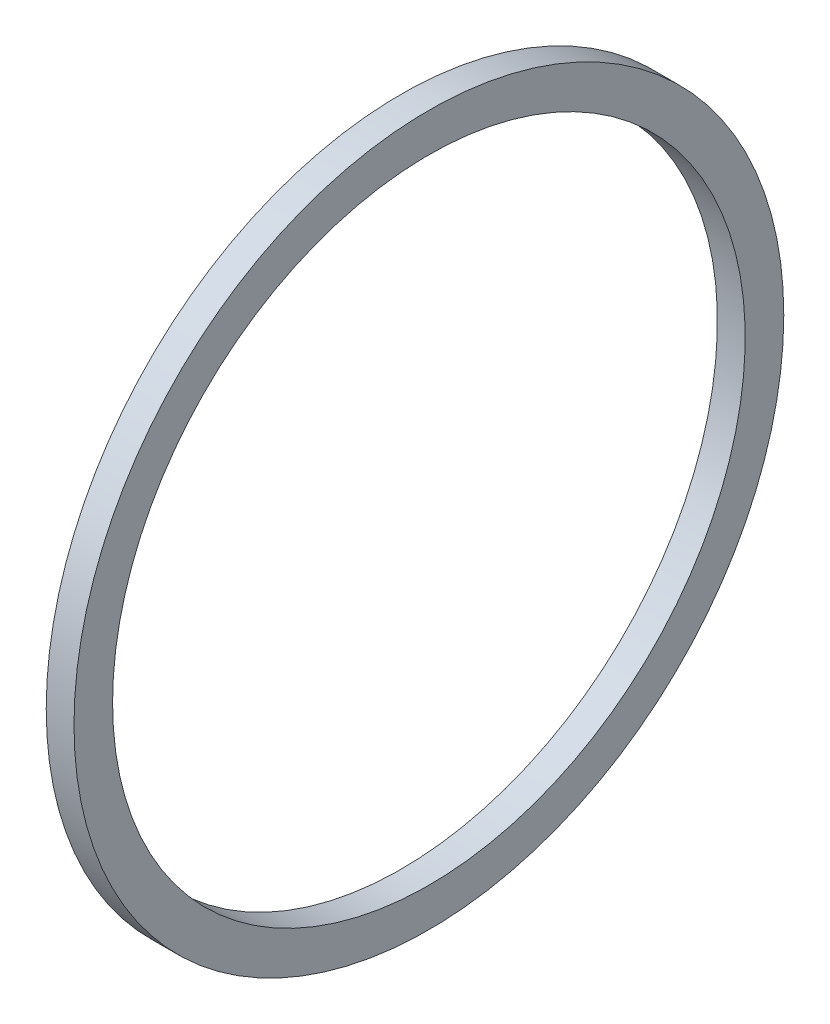
ISO-10303-21;
HEADER;
FILE_DESCRIPTION(('STEP AP214'),'2;1');
FILE_NAME('part.step','',(''),(''),'','','');
FILE_SCHEMA(('AUTOMOTIVE_DESIGN { 1 0 10303 214 1 1 1 1 }'));
ENDSEC;
DATA;
#1=APPLICATION_CONTEXT('core data for automotive mechanical design processes');
#2=APPLICATION_PROTOCOL_DEFINITION('international standard','automotive_design',2000,#1);
#3=PRODUCT_CONTEXT('',#1,'mechanical');
#4=PRODUCT('Part','Part','',(#3));
#5=PRODUCT_RELATED_PRODUCT_CATEGORY('part','',(#4));
#6=PRODUCT_DEFINITION_FORMATION('','',#4);
#7=PRODUCT_DEFINITION_CONTEXT('part definition',#1,'design');
#8=PRODUCT_DEFINITION('design','',#6,#7);
#9=PRODUCT_DEFINITION_SHAPE('','',#8);
#10=(LENGTH_UNIT() NAMED_UNIT(*) SI_UNIT(.MILLI.,.METRE.));
#11=(NAMED_UNIT(*) PLANE_ANGLE_UNIT() SI_UNIT($,.RADIAN.));
#12=(NAMED_UNIT(*) SI_UNIT($,.STERADIAN.) SOLID_ANGLE_UNIT());
#13=UNCERTAINTY_MEASURE_WITH_UNIT(LENGTH_MEASURE(1.E-05),#10,'distance_accuracy_value','');
#14=(GEOMETRIC_REPRESENTATION_CONTEXT(3) GLOBAL_UNCERTAINTY_ASSIGNED_CONTEXT((#13)) GLOBAL_UNIT_ASSIGNED_CONTEXT((#10,
#11,#12)) REPRESENTATION_CONTEXT('',''));
#15=CARTESIAN_POINT('',(0.,0.,0.));
#16=DIRECTION('',(0.,0.,1.));
#17=DIRECTION('',(1.,0.,0.));
#18=AXIS2_PLACEMENT_3D('',#15,#16,#17);
#19=CARTESIAN_POINT('',(4.5,102.5,0.));
#20=DIRECTION('',(-1.,0.,0.));
#21=DIRECTION('',(0.,0.,1.));
#22=AXIS2_PLACEMENT_3D('',#19,#20,#21);
#23=PLANE('',#22);
#24=CARTESIAN_POINT('',(4.5,0.,0.));
#25=DIRECTION('',(-1.,0.,0.));
#26=DIRECTION('',(0.,0.,1.));
#27=AXIS2_PLACEMENT_3D('',#24,#25,#26);
#28=CIRCLE('',#27,115.);
#29=CARTESIAN_POINT('',(4.5,0.,115.));
#30=VERTEX_POINT('',#29);
#31=EDGE_CURVE('E54',#30,#30,#28,.T.);
#32=ORIENTED_EDGE('',*,*,#31,.F.);
#33=EDGE_LOOP('',(#32));
#34=FACE_BOUND('',#33,.T.);
#35=CARTESIAN_POINT('',(4.5,0.,0.));
#36=DIRECTION('',(-1.,0.,0.));
#37=DIRECTION('',(0.,0.,1.));
#38=AXIS2_PLACEMENT_3D('',#35,#36,#37);
#39=CIRCLE('',#38,102.5);
#40=CARTESIAN_POINT('',(4.5,0.,102.5));
#41=VERTEX_POINT('',#40);
#42=EDGE_CURVE('E10',#41,#41,#39,.T.);
#43=ORIENTED_EDGE('',*,*,#42,.T.);
#44=EDGE_LOOP('',(#43));
#45=FACE_BOUND('',#44,.T.);
#46=ADVANCED_FACE('F37',(#34,#45),#23,.F.);
#47=CARTESIAN_POINT('',(0.,0.,0.));
#48=DIRECTION('',(-1.,0.,0.));
#49=DIRECTION('',(0.,0.,1.));
#50=AXIS2_PLACEMENT_3D('',#47,#48,#49);
#51=CYLINDRICAL_SURFACE('',#50,102.5);
#52=ORIENTED_EDGE('',*,*,#42,.F.);
#53=EDGE_LOOP('',(#52));
#54=FACE_BOUND('',#53,.T.);
#55=CARTESIAN_POINT('',(-4.5,0.,0.));
#56=DIRECTION('',(-1.,0.,0.));
#57=DIRECTION('',(0.,0.,1.));
#58=AXIS2_PLACEMENT_3D('',#55,#56,#57);
#59=CIRCLE('',#58,102.5);
#60=CARTESIAN_POINT('',(-4.5,0.,102.5));
#61=VERTEX_POINT('',#60);
#62=EDGE_CURVE('E44',#61,#61,#59,.T.);
#63=ORIENTED_EDGE('',*,*,#62,.T.);
#64=EDGE_LOOP('',(#63));
#65=FACE_BOUND('',#64,.T.);
#66=ADVANCED_FACE('F64',(#54,#65),#51,.F.);
#67=CARTESIAN_POINT('',(-4.5,102.5,0.));
#68=DIRECTION('',(1.,0.,0.));
#69=DIRECTION('',(0.,0.,-1.));
#70=AXIS2_PLACEMENT_3D('',#67,#68,#69);
#71=PLANE('',#70);
#72=ORIENTED_EDGE('',*,*,#62,.F.);
#73=EDGE_LOOP('',(#72));
#74=FACE_BOUND('',#73,.T.);
#75=CARTESIAN_POINT('',(-4.5,0.,0.));
#76=DIRECTION('',(-1.,0.,0.));
#77=DIRECTION('',(0.,0.,1.));
#78=AXIS2_PLACEMENT_3D('',#75,#76,#77);
#79=CIRCLE('',#78,115.);
#80=CARTESIAN_POINT('',(-4.5,0.,115.));
#81=VERTEX_POINT('',#80);
#82=EDGE_CURVE('E49',#81,#81,#79,.T.);
#83=ORIENTED_EDGE('',*,*,#82,.T.);
#84=EDGE_LOOP('',(#83));
#85=FACE_BOUND('',#84,.T.);
#86=ADVANCED_FACE('F68',(#74,#85),#71,.F.);
#87=CARTESIAN_POINT('',(0.,0.,0.));
#88=DIRECTION('',(-1.,0.,0.));
#89=DIRECTION('',(0.,0.,1.));
#90=AXIS2_PLACEMENT_3D('',#87,#88,#89);
#91=CYLINDRICAL_SURFACE('',#90,115.);
#92=ORIENTED_EDGE('',*,*,#82,.F.);
#93=EDGE_LOOP('',(#92));
#94=FACE_BOUND('',#93,.T.);
#95=ORIENTED_EDGE('',*,*,#31,.T.);
#96=EDGE_LOOP('',(#95));
#97=FACE_BOUND('',#96,.T.);
#98=ADVANCED_FACE('F61',(#94,#97),#91,.T.);
#99=CLOSED_SHELL('',(#46,#66,#86,#98));
#100=MANIFOLD_SOLID_BREP('B2',#99);
#101=ADVANCED_BREP_SHAPE_REPRESENTATION('',(#18,#100),#14);
#102=SHAPE_DEFINITION_REPRESENTATION(#9,#101);
ENDSEC;
END-ISO-10303-21;
